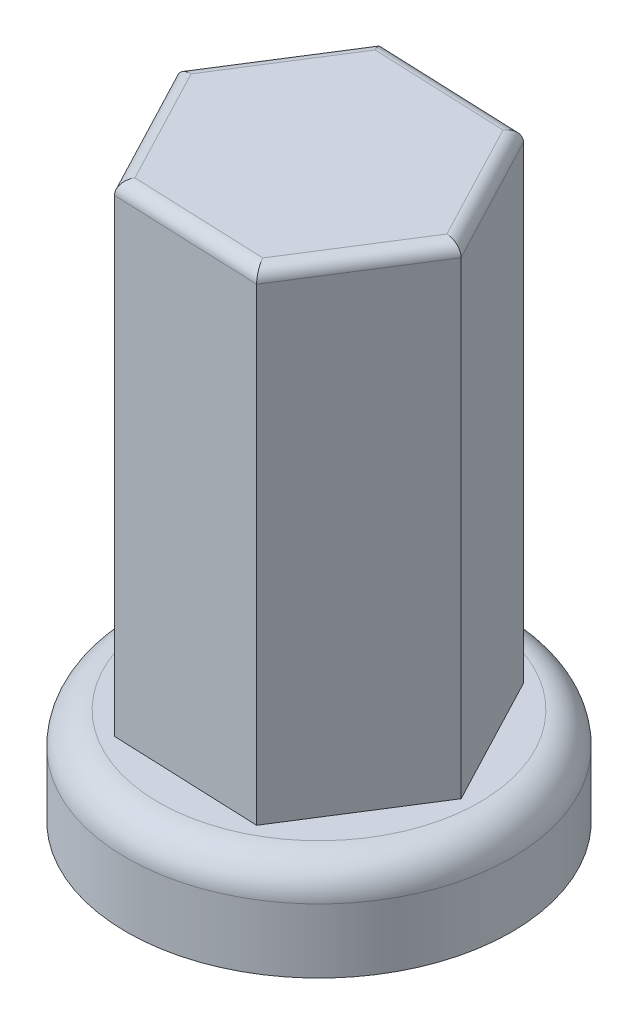
ISO-10303-21;
HEADER;
FILE_DESCRIPTION(('STEP AP214'),'2;1');
FILE_NAME('part.step','',(''),(''),'','','');
FILE_SCHEMA(('AUTOMOTIVE_DESIGN { 1 0 10303 214 1 1 1 1 }'));
ENDSEC;
DATA;
#1=APPLICATION_CONTEXT('core data for automotive mechanical design processes');
#2=APPLICATION_PROTOCOL_DEFINITION('international standard','automotive_design',2000,#1);
#3=PRODUCT_CONTEXT('',#1,'mechanical');
#4=PRODUCT('Part','Part','',(#3));
#5=PRODUCT_RELATED_PRODUCT_CATEGORY('part','',(#4));
#6=PRODUCT_DEFINITION_FORMATION('','',#4);
#7=PRODUCT_DEFINITION_CONTEXT('part definition',#1,'design');
#8=PRODUCT_DEFINITION('design','',#6,#7);
#9=PRODUCT_DEFINITION_SHAPE('','',#8);
#10=(LENGTH_UNIT() NAMED_UNIT(*) SI_UNIT(.MILLI.,.METRE.));
#11=(NAMED_UNIT(*) PLANE_ANGLE_UNIT() SI_UNIT($,.RADIAN.));
#12=(NAMED_UNIT(*) SI_UNIT($,.STERADIAN.) SOLID_ANGLE_UNIT());
#13=UNCERTAINTY_MEASURE_WITH_UNIT(LENGTH_MEASURE(1.E-05),#10,'distance_accuracy_value','');
#14=(GEOMETRIC_REPRESENTATION_CONTEXT(3) GLOBAL_UNCERTAINTY_ASSIGNED_CONTEXT((#13)) GLOBAL_UNIT_ASSIGNED_CONTEXT((#10,
#11,#12)) REPRESENTATION_CONTEXT('',''));
#15=CARTESIAN_POINT('',(0.,0.,0.));
#16=DIRECTION('',(0.,0.,1.));
#17=DIRECTION('',(1.,0.,0.));
#18=AXIS2_PLACEMENT_3D('',#15,#16,#17);
#19=CARTESIAN_POINT('',(0.,3.81,0.));
#20=DIRECTION('',(0.,1.,0.));
#21=DIRECTION('',(0.,0.,1.));
#22=AXIS2_PLACEMENT_3D('',#19,#20,#21);
#23=PLANE('',#22);
#24=CARTESIAN_POINT('',(0.,3.81,0.));
#25=DIRECTION('',(0.,1.,0.));
#26=DIRECTION('',(0.,0.,1.));
#27=AXIS2_PLACEMENT_3D('',#24,#25,#26);
#28=CIRCLE('',#27,6.35);
#29=CARTESIAN_POINT('',(0.,3.81,6.35));
#30=VERTEX_POINT('',#29);
#31=EDGE_CURVE('E145',#30,#30,#28,.T.);
#32=ORIENTED_EDGE('',*,*,#31,.T.);
#33=EDGE_LOOP('',(#32));
#34=FACE_BOUND('',#33,.T.);
#35=DIRECTION('',(-0.464619383568668,0.,-0.885510490289229));
#36=VECTOR('',#35,1.);
#37=CARTESIAN_POINT('',(5.86109377163365,3.81,0.236882108759886));
#38=LINE('',#37,#36);
#39=CARTESIAN_POINT('',(5.86109377163365,3.81,0.236882108759886));
#40=VERTEX_POINT('',#39);
#41=CARTESIAN_POINT('',(3.13569280970491,3.81,-4.95741504581755));
#42=VERTEX_POINT('',#41);
#43=EDGE_CURVE('E106',#40,#42,#38,.T.);
#44=ORIENTED_EDGE('',*,*,#43,.F.);
#45=DIRECTION('',(0.534564888123752,0.,-0.845127434405747));
#46=VECTOR('',#45,1.);
#47=CARTESIAN_POINT('',(2.72540096192874,3.81,5.19429715457744));
#48=LINE('',#47,#46);
#49=CARTESIAN_POINT('',(2.72540096192874,3.81,5.19429715457744));
#50=VERTEX_POINT('',#49);
#51=EDGE_CURVE('E113',#50,#40,#48,.T.);
#52=ORIENTED_EDGE('',*,*,#51,.F.);
#53=DIRECTION('',(0.99918427169242,0.,0.0403830558834821));
#54=VECTOR('',#53,1.);
#55=CARTESIAN_POINT('',(-3.13569280970492,3.81,4.95741504581755));
#56=LINE('',#55,#54);
#57=CARTESIAN_POINT('',(-3.13569280970492,3.81,4.95741504581755));
#58=VERTEX_POINT('',#57);
#59=EDGE_CURVE('E133',#58,#50,#56,.T.);
#60=ORIENTED_EDGE('',*,*,#59,.F.);
#61=DIRECTION('',(0.464619383568668,0.,0.885510490289229));
#62=VECTOR('',#61,1.);
#63=CARTESIAN_POINT('',(-5.86109377163366,3.81,-0.236882108759885));
#64=LINE('',#63,#62);
#65=CARTESIAN_POINT('',(-5.86109377163366,3.81,-0.236882108759885));
#66=VERTEX_POINT('',#65);
#67=EDGE_CURVE('E130',#66,#58,#64,.T.);
#68=ORIENTED_EDGE('',*,*,#67,.F.);
#69=DIRECTION('',(-0.534564888123752,0.,0.845127434405747));
#70=VECTOR('',#69,1.);
#71=CARTESIAN_POINT('',(-2.72540096192874,3.81,-5.19429715457744));
#72=LINE('',#71,#70);
#73=CARTESIAN_POINT('',(-2.72540096192874,3.81,-5.19429715457744));
#74=VERTEX_POINT('',#73);
#75=EDGE_CURVE('E124',#74,#66,#72,.T.);
#76=ORIENTED_EDGE('',*,*,#75,.F.);
#77=DIRECTION('',(-0.99918427169242,0.,-0.040383055883482));
#78=VECTOR('',#77,1.);
#79=CARTESIAN_POINT('',(3.13569280970491,3.81,-4.95741504581755));
#80=LINE('',#79,#78);
#81=EDGE_CURVE('E122',#42,#74,#80,.T.);
#82=ORIENTED_EDGE('',*,*,#81,.F.);
#83=EDGE_LOOP('',(#44,#52,#60,#68,#76,#82));
#84=FACE_BOUND('',#83,.T.);
#85=ADVANCED_FACE('F32',(#34,#84),#23,.T.);
#86=CARTESIAN_POINT('',(0.,3.81,0.));
#87=DIRECTION('',(0.,-1.,0.));
#88=DIRECTION('',(0.,0.,-1.));
#89=AXIS2_PLACEMENT_3D('',#86,#87,#88);
#90=CYLINDRICAL_SURFACE('',#89,7.62);
#91=CARTESIAN_POINT('',(0.,2.54,0.));
#92=DIRECTION('',(0.,1.,0.));
#93=DIRECTION('',(0.,0.,1.));
#94=AXIS2_PLACEMENT_3D('',#91,#92,#93);
#95=CIRCLE('',#94,7.62);
#96=CARTESIAN_POINT('',(0.,2.54,7.62));
#97=VERTEX_POINT('',#96);
#98=EDGE_CURVE('E148',#97,#97,#95,.F.);
#99=ORIENTED_EDGE('',*,*,#98,.T.);
#100=EDGE_LOOP('',(#99));
#101=FACE_BOUND('',#100,.T.);
#102=CARTESIAN_POINT('',(0.,0.,0.));
#103=DIRECTION('',(0.,1.,0.));
#104=DIRECTION('',(0.,0.,1.));
#105=AXIS2_PLACEMENT_3D('',#102,#103,#104);
#106=CIRCLE('',#105,7.62);
#107=CARTESIAN_POINT('',(0.,0.,7.62));
#108=VERTEX_POINT('',#107);
#109=EDGE_CURVE('E109',#108,#108,#106,.T.);
#110=ORIENTED_EDGE('',*,*,#109,.T.);
#111=EDGE_LOOP('',(#110));
#112=FACE_BOUND('',#111,.T.);
#113=ADVANCED_FACE('F233',(#101,#112),#90,.T.);
#114=CARTESIAN_POINT('',(0.,0.,0.));
#115=DIRECTION('',(0.,1.,0.));
#116=DIRECTION('',(0.,0.,1.));
#117=AXIS2_PLACEMENT_3D('',#114,#115,#116);
#118=PLANE('',#117);
#119=CARTESIAN_POINT('',(0.,0.,0.));
#120=DIRECTION('',(0.,-1.,0.));
#121=DIRECTION('',(0.,0.,-1.));
#122=AXIS2_PLACEMENT_3D('',#119,#120,#121);
#123=CIRCLE('',#122,4.699);
#124=CARTESIAN_POINT('',(0.,0.,-4.699));
#125=VERTEX_POINT('',#124);
#126=EDGE_CURVE('E355',#125,#125,#123,.T.);
#127=ORIENTED_EDGE('',*,*,#126,.F.);
#128=EDGE_LOOP('',(#127));
#129=FACE_BOUND('',#128,.T.);
#130=ORIENTED_EDGE('',*,*,#109,.F.);
#131=EDGE_LOOP('',(#130));
#132=FACE_BOUND('',#131,.T.);
#133=ADVANCED_FACE('F239',(#129,#132),#118,.F.);
#134=CARTESIAN_POINT('',(2.72540096192874,22.86,5.19429715457744));
#135=DIRECTION('',(-0.845127434405747,0.,-0.534564888123752));
#136=DIRECTION('',(-0.534564888123752,0.,0.845127434405747));
#137=AXIS2_PLACEMENT_3D('',#134,#135,#136);
#138=PLANE('',#137);
#139=DIRECTION('',(0.,-1.,0.));
#140=VECTOR('',#139,1.);
#141=CARTESIAN_POINT('',(5.86109377163365,22.86,0.236882108759886));
#142=LINE('',#141,#140);
#143=CARTESIAN_POINT('',(5.86109377163365,22.352,0.236882108759886));
#144=VERTEX_POINT('',#143);
#145=EDGE_CURVE('E102',#144,#40,#142,.T.);
#146=ORIENTED_EDGE('',*,*,#145,.F.);
#147=DIRECTION('',(0.534564888123752,0.,-0.845127434405747));
#148=VECTOR('',#147,1.);
#149=CARTESIAN_POINT('',(2.72540096192874,22.352,5.19429715457744));
#150=LINE('',#149,#148);
#151=CARTESIAN_POINT('',(2.72540096192874,22.352,5.19429715457744));
#152=VERTEX_POINT('',#151);
#153=EDGE_CURVE('E41',#144,#152,#150,.F.);
#154=ORIENTED_EDGE('',*,*,#153,.T.);
#155=DIRECTION('',(0.,-1.,0.));
#156=VECTOR('',#155,1.);
#157=CARTESIAN_POINT('',(2.72540096192874,22.86,5.19429715457744));
#158=LINE('',#157,#156);
#159=EDGE_CURVE('E115',#152,#50,#158,.T.);
#160=ORIENTED_EDGE('',*,*,#159,.T.);
#161=ORIENTED_EDGE('',*,*,#51,.T.);
#162=EDGE_LOOP('',(#146,#154,#160,#161));
#163=FACE_BOUND('',#162,.T.);
#164=ADVANCED_FACE('F114',(#163),#138,.F.);
#165=CARTESIAN_POINT('',(5.86109377163365,22.86,0.236882108759886));
#166=DIRECTION('',(-0.885510490289229,0.,0.464619383568668));
#167=DIRECTION('',(0.464619383568668,0.,0.885510490289229));
#168=AXIS2_PLACEMENT_3D('',#165,#166,#167);
#169=PLANE('',#168);
#170=DIRECTION('',(0.,-1.,0.));
#171=VECTOR('',#170,1.);
#172=CARTESIAN_POINT('',(3.13569280970491,22.86,-4.95741504581755));
#173=LINE('',#172,#171);
#174=CARTESIAN_POINT('',(3.13569280970491,22.352,-4.95741504581755));
#175=VERTEX_POINT('',#174);
#176=EDGE_CURVE('E110',#175,#42,#173,.T.);
#177=ORIENTED_EDGE('',*,*,#176,.F.);
#178=DIRECTION('',(-0.464619383568668,0.,-0.885510490289229));
#179=VECTOR('',#178,1.);
#180=CARTESIAN_POINT('',(5.86109377163365,22.352,0.236882108759886));
#181=LINE('',#180,#179);
#182=EDGE_CURVE('E56',#175,#144,#181,.F.);
#183=ORIENTED_EDGE('',*,*,#182,.T.);
#184=ORIENTED_EDGE('',*,*,#145,.T.);
#185=ORIENTED_EDGE('',*,*,#43,.T.);
#186=EDGE_LOOP('',(#177,#183,#184,#185));
#187=FACE_BOUND('',#186,.T.);
#188=ADVANCED_FACE('F104',(#187),#169,.F.);
#189=CARTESIAN_POINT('',(3.13569280970491,22.86,-4.95741504581755));
#190=DIRECTION('',(-0.040383055883482,0.,0.99918427169242));
#191=DIRECTION('',(0.99918427169242,0.,0.040383055883482));
#192=AXIS2_PLACEMENT_3D('',#189,#190,#191);
#193=PLANE('',#192);
#194=DIRECTION('',(0.,-1.,0.));
#195=VECTOR('',#194,1.);
#196=CARTESIAN_POINT('',(-2.72540096192874,22.86,-5.19429715457744));
#197=LINE('',#196,#195);
#198=CARTESIAN_POINT('',(-2.72540096192874,22.352,-5.19429715457744));
#199=VERTEX_POINT('',#198);
#200=EDGE_CURVE('E140',#199,#74,#197,.T.);
#201=ORIENTED_EDGE('',*,*,#200,.F.);
#202=DIRECTION('',(-0.99918427169242,0.,-0.040383055883482));
#203=VECTOR('',#202,1.);
#204=CARTESIAN_POINT('',(3.13569280970491,22.352,-4.95741504581755));
#205=LINE('',#204,#203);
#206=EDGE_CURVE('E169',#199,#175,#205,.F.);
#207=ORIENTED_EDGE('',*,*,#206,.T.);
#208=ORIENTED_EDGE('',*,*,#176,.T.);
#209=ORIENTED_EDGE('',*,*,#81,.T.);
#210=EDGE_LOOP('',(#201,#207,#208,#209));
#211=FACE_BOUND('',#210,.T.);
#212=ADVANCED_FACE('F223',(#211),#193,.F.);
#213=CARTESIAN_POINT('',(-2.72540096192874,22.86,-5.19429715457744));
#214=DIRECTION('',(0.845127434405747,0.,0.534564888123752));
#215=DIRECTION('',(0.534564888123752,0.,-0.845127434405747));
#216=AXIS2_PLACEMENT_3D('',#213,#214,#215);
#217=PLANE('',#216);
#218=DIRECTION('',(0.,-1.,0.));
#219=VECTOR('',#218,1.);
#220=CARTESIAN_POINT('',(-5.86109377163366,22.86,-0.236882108759885));
#221=LINE('',#220,#219);
#222=CARTESIAN_POINT('',(-5.86109377163366,22.352,-0.236882108759885));
#223=VERTEX_POINT('',#222);
#224=EDGE_CURVE('E138',#223,#66,#221,.T.);
#225=ORIENTED_EDGE('',*,*,#224,.F.);
#226=DIRECTION('',(-0.534564888123752,0.,0.845127434405747));
#227=VECTOR('',#226,1.);
#228=CARTESIAN_POINT('',(-2.72540096192874,22.352,-5.19429715457744));
#229=LINE('',#228,#227);
#230=EDGE_CURVE('E167',#223,#199,#229,.F.);
#231=ORIENTED_EDGE('',*,*,#230,.T.);
#232=ORIENTED_EDGE('',*,*,#200,.T.);
#233=ORIENTED_EDGE('',*,*,#75,.T.);
#234=EDGE_LOOP('',(#225,#231,#232,#233));
#235=FACE_BOUND('',#234,.T.);
#236=ADVANCED_FACE('F221',(#235),#217,.F.);
#237=CARTESIAN_POINT('',(-5.86109377163366,22.86,-0.236882108759885));
#238=DIRECTION('',(0.885510490289229,0.,-0.464619383568668));
#239=DIRECTION('',(-0.464619383568668,0.,-0.885510490289229));
#240=AXIS2_PLACEMENT_3D('',#237,#238,#239);
#241=PLANE('',#240);
#242=DIRECTION('',(0.,-1.,0.));
#243=VECTOR('',#242,1.);
#244=CARTESIAN_POINT('',(-3.13569280970492,22.86,4.95741504581755));
#245=LINE('',#244,#243);
#246=CARTESIAN_POINT('',(-3.13569280970492,22.352,4.95741504581755));
#247=VERTEX_POINT('',#246);
#248=EDGE_CURVE('E136',#247,#58,#245,.T.);
#249=ORIENTED_EDGE('',*,*,#248,.F.);
#250=DIRECTION('',(0.464619383568668,0.,0.885510490289229));
#251=VECTOR('',#250,1.);
#252=CARTESIAN_POINT('',(-5.86109377163366,22.352,-0.236882108759886));
#253=LINE('',#252,#251);
#254=EDGE_CURVE('E164',#247,#223,#253,.F.);
#255=ORIENTED_EDGE('',*,*,#254,.T.);
#256=ORIENTED_EDGE('',*,*,#224,.T.);
#257=ORIENTED_EDGE('',*,*,#67,.T.);
#258=EDGE_LOOP('',(#249,#255,#256,#257));
#259=FACE_BOUND('',#258,.T.);
#260=ADVANCED_FACE('F208',(#259),#241,.F.);
#261=CARTESIAN_POINT('',(-3.13569280970492,22.86,4.95741504581755));
#262=DIRECTION('',(0.0403830558834821,0.,-0.99918427169242));
#263=DIRECTION('',(-0.99918427169242,0.,-0.0403830558834821));
#264=AXIS2_PLACEMENT_3D('',#261,#262,#263);
#265=PLANE('',#264);
#266=ORIENTED_EDGE('',*,*,#159,.F.);
#267=DIRECTION('',(0.99918427169242,0.,0.0403830558834821));
#268=VECTOR('',#267,1.);
#269=CARTESIAN_POINT('',(-3.13569280970492,22.352,4.95741504581755));
#270=LINE('',#269,#268);
#271=EDGE_CURVE('E11',#152,#247,#270,.F.);
#272=ORIENTED_EDGE('',*,*,#271,.T.);
#273=ORIENTED_EDGE('',*,*,#248,.T.);
#274=ORIENTED_EDGE('',*,*,#59,.T.);
#275=EDGE_LOOP('',(#266,#272,#273,#274));
#276=FACE_BOUND('',#275,.T.);
#277=ADVANCED_FACE('F205',(#276),#265,.F.);
#278=CARTESIAN_POINT('',(5.86109377163365,22.86,0.236882108759887));
#279=DIRECTION('',(0.,1.,0.));
#280=DIRECTION('',(0.,0.,1.));
#281=AXIS2_PLACEMENT_3D('',#278,#279,#280);
#282=PLANE('',#281);
#283=DIRECTION('',(-0.534564888123752,0.,0.845127434405747));
#284=VECTOR('',#283,1.);
#285=CARTESIAN_POINT('',(-5.43176903495554,22.86,0.0346768544069818));
#286=LINE('',#285,#284);
#287=CARTESIAN_POINT('',(-2.45286086573586,22.86,-4.67486743911969));
#288=VERTEX_POINT('',#287);
#289=CARTESIAN_POINT('',(-5.27498439447029,22.86,-0.213193897883897));
#290=VERTEX_POINT('',#289);
#291=EDGE_CURVE('E159',#288,#290,#286,.T.);
#292=ORIENTED_EDGE('',*,*,#291,.T.);
#293=DIRECTION('',(0.464619383568668,0.,0.885510490289229));
#294=VECTOR('',#293,1.);
#295=CARTESIAN_POINT('',(-2.68585348063799,22.86,4.72138839896467));
#296=LINE('',#295,#294);
#297=CARTESIAN_POINT('',(-2.82212352873442,22.86,4.4616735412358));
#298=VERTEX_POINT('',#297);
#299=EDGE_CURVE('E161',#290,#298,#296,.T.);
#300=ORIENTED_EDGE('',*,*,#299,.T.);
#301=DIRECTION('',(0.99918427169242,0.,0.0403830558834821));
#302=VECTOR('',#301,1.);
#303=CARTESIAN_POINT('',(2.74591555431754,22.86,4.68671154455769));
#304=LINE('',#303,#302);
#305=CARTESIAN_POINT('',(2.45286086573586,22.86,4.67486743911969));
#306=VERTEX_POINT('',#305);
#307=EDGE_CURVE('E151',#298,#306,#304,.T.);
#308=ORIENTED_EDGE('',*,*,#307,.T.);
#309=DIRECTION('',(0.534564888123752,0.,-0.845127434405747));
#310=VECTOR('',#309,1.);
#311=CARTESIAN_POINT('',(5.43176903495553,22.86,-0.0346768544069797));
#312=LINE('',#311,#310);
#313=CARTESIAN_POINT('',(5.27498439447029,22.86,0.213193897883898));
#314=VERTEX_POINT('',#313);
#315=EDGE_CURVE('E153',#306,#314,#312,.T.);
#316=ORIENTED_EDGE('',*,*,#315,.T.);
#317=DIRECTION('',(-0.464619383568668,0.,-0.885510490289229));
#318=VECTOR('',#317,1.);
#319=CARTESIAN_POINT('',(2.68585348063798,22.86,-4.72138839896467));
#320=LINE('',#319,#318);
#321=CARTESIAN_POINT('',(2.82212352873442,22.86,-4.4616735412358));
#322=VERTEX_POINT('',#321);
#323=EDGE_CURVE('E155',#314,#322,#320,.T.);
#324=ORIENTED_EDGE('',*,*,#323,.T.);
#325=DIRECTION('',(-0.99918427169242,0.,-0.040383055883482));
#326=VECTOR('',#325,1.);
#327=CARTESIAN_POINT('',(-2.74591555431755,22.86,-4.68671154455769));
#328=LINE('',#327,#326);
#329=EDGE_CURVE('E157',#322,#288,#328,.T.);
#330=ORIENTED_EDGE('',*,*,#329,.T.);
#331=EDGE_LOOP('',(#292,#300,#308,#316,#324,#330));
#332=FACE_BOUND('',#331,.T.);
#333=ADVANCED_FACE('F250',(#332),#282,.T.);
#334=CARTESIAN_POINT('',(0.,2.54,0.));
#335=DIRECTION('',(0.,1.,0.));
#336=DIRECTION('',(0.,0.,1.));
#337=AXIS2_PLACEMENT_3D('',#334,#335,#336);
#338=TOROIDAL_SURFACE('',#337,6.35,1.27);
#339=ORIENTED_EDGE('',*,*,#98,.F.);
#340=EDGE_LOOP('',(#339));
#341=FACE_BOUND('',#340,.T.);
#342=ORIENTED_EDGE('',*,*,#31,.F.);
#343=EDGE_LOOP('',(#342));
#344=FACE_BOUND('',#343,.T.);
#345=ADVANCED_FACE('F247',(#341,#344),#338,.T.);
#346=CARTESIAN_POINT('',(5.41125444256672,22.352,0.47290875561277));
#347=DIRECTION('',(0.464619383568668,0.,0.885510490289229));
#348=DIRECTION('',(0.885510490289229,0.,-0.464619383568668));
#349=AXIS2_PLACEMENT_3D('',#346,#347,#348);
#350=CYLINDRICAL_SURFACE('',#349,0.508);
#351=CARTESIAN_POINT('',(5.27498439447029,22.352,0.213193897883898));
#352=DIRECTION('',(-0.0403830558834822,0.,0.99918427169242));
#353=DIRECTION('',(-0.99918427169242,0.,-0.0403830558834823));
#354=AXIS2_PLACEMENT_3D('',#351,#352,#353);
#355=ELLIPSE('',#354,0.58658787349666,0.508);
#356=EDGE_CURVE('E183',#144,#314,#355,.T.);
#357=ORIENTED_EDGE('',*,*,#356,.F.);
#358=ORIENTED_EDGE('',*,*,#182,.F.);
#359=CARTESIAN_POINT('',(2.82212352873442,22.352,-4.4616735412358));
#360=DIRECTION('',(0.845127434405747,0.,0.534564888123752));
#361=DIRECTION('',(-0.534564888123752,0.,0.845127434405747));
#362=AXIS2_PLACEMENT_3D('',#359,#360,#361);
#363=ELLIPSE('',#362,0.58658787349666,0.508);
#364=EDGE_CURVE('E36',#322,#175,#363,.F.);
#365=ORIENTED_EDGE('',*,*,#364,.F.);
#366=ORIENTED_EDGE('',*,*,#323,.F.);
#367=EDGE_LOOP('',(#357,#358,#365,#366));
#368=FACE_BOUND('',#367,.T.);
#369=ADVANCED_FACE('F34',(#368),#350,.T.);
#370=CARTESIAN_POINT('',(6.04572510313293,22.352,-4.33138838141786));
#371=DIRECTION('',(0.99918427169242,0.,0.040383055883482));
#372=DIRECTION('',(0.040383055883482,0.,-0.99918427169242));
#373=AXIS2_PLACEMENT_3D('',#370,#371,#372);
#374=CYLINDRICAL_SURFACE('',#373,0.508);
#375=ORIENTED_EDGE('',*,*,#364,.T.);
#376=ORIENTED_EDGE('',*,*,#206,.F.);
#377=CARTESIAN_POINT('',(-2.45286086573586,22.352,-4.67486743911969));
#378=DIRECTION('',(0.885510490289229,0.,-0.464619383568668));
#379=DIRECTION('',(0.464619383568668,0.,0.885510490289229));
#380=AXIS2_PLACEMENT_3D('',#377,#378,#379);
#381=ELLIPSE('',#380,0.58658787349666,0.508);
#382=EDGE_CURVE('E181',#288,#199,#381,.F.);
#383=ORIENTED_EDGE('',*,*,#382,.F.);
#384=ORIENTED_EDGE('',*,*,#329,.F.);
#385=EDGE_LOOP('',(#375,#376,#383,#384));
#386=FACE_BOUND('',#385,.T.);
#387=ADVANCED_FACE('F192',(#386),#374,.T.);
#388=CARTESIAN_POINT('',(5.43176903495553,22.352,-0.0346768544069794));
#389=DIRECTION('',(-0.534564888123752,0.,0.845127434405747));
#390=DIRECTION('',(0.845127434405747,0.,0.534564888123752));
#391=AXIS2_PLACEMENT_3D('',#388,#389,#390);
#392=CYLINDRICAL_SURFACE('',#391,0.508);
#393=ORIENTED_EDGE('',*,*,#356,.T.);
#394=ORIENTED_EDGE('',*,*,#315,.F.);
#395=CARTESIAN_POINT('',(2.45286086573586,22.352,4.67486743911969));
#396=DIRECTION('',(-0.885510490289229,0.,0.464619383568668));
#397=DIRECTION('',(-0.464619383568668,0.,-0.885510490289229));
#398=AXIS2_PLACEMENT_3D('',#395,#396,#397);
#399=ELLIPSE('',#398,0.58658787349666,0.508);
#400=EDGE_CURVE('E178',#152,#306,#399,.T.);
#401=ORIENTED_EDGE('',*,*,#400,.F.);
#402=ORIENTED_EDGE('',*,*,#153,.F.);
#403=EDGE_LOOP('',(#393,#394,#401,#402));
#404=FACE_BOUND('',#403,.T.);
#405=ADVANCED_FACE('F197',(#404),#392,.T.);
#406=CARTESIAN_POINT('',(-2.29607622525062,22.352,-4.92273819141057));
#407=DIRECTION('',(0.534564888123752,0.,-0.845127434405747));
#408=DIRECTION('',(-0.845127434405747,0.,-0.534564888123752));
#409=AXIS2_PLACEMENT_3D('',#406,#407,#408);
#410=CYLINDRICAL_SURFACE('',#409,0.508);
#411=ORIENTED_EDGE('',*,*,#382,.T.);
#412=ORIENTED_EDGE('',*,*,#230,.F.);
#413=CARTESIAN_POINT('',(-5.27498439447029,22.352,-0.2131938978839));
#414=DIRECTION('',(0.040383055883482,0.,-0.99918427169242));
#415=DIRECTION('',(0.99918427169242,0.,0.0403830558834822));
#416=AXIS2_PLACEMENT_3D('',#413,#414,#415);
#417=ELLIPSE('',#416,0.58658787349666,0.508);
#418=EDGE_CURVE('E175',#290,#223,#417,.F.);
#419=ORIENTED_EDGE('',*,*,#418,.F.);
#420=ORIENTED_EDGE('',*,*,#291,.F.);
#421=EDGE_LOOP('',(#411,#412,#419,#420));
#422=FACE_BOUND('',#421,.T.);
#423=ADVANCED_FACE('F218',(#422),#410,.T.);
#424=CARTESIAN_POINT('',(5.67646244013437,22.352,4.80515259893763));
#425=DIRECTION('',(-0.99918427169242,0.,-0.0403830558834821));
#426=DIRECTION('',(-0.0403830558834821,0.,0.99918427169242));
#427=AXIS2_PLACEMENT_3D('',#424,#425,#426);
#428=CYLINDRICAL_SURFACE('',#427,0.508);
#429=ORIENTED_EDGE('',*,*,#400,.T.);
#430=ORIENTED_EDGE('',*,*,#307,.F.);
#431=CARTESIAN_POINT('',(-2.82212352873442,22.352,4.4616735412358));
#432=DIRECTION('',(-0.845127434405747,0.,-0.534564888123752));
#433=DIRECTION('',(-0.534564888123752,0.,0.845127434405747));
#434=AXIS2_PLACEMENT_3D('',#431,#432,#433);
#435=ELLIPSE('',#434,0.58658787349666,0.508);
#436=EDGE_CURVE('E173',#247,#298,#435,.T.);
#437=ORIENTED_EDGE('',*,*,#436,.F.);
#438=ORIENTED_EDGE('',*,*,#271,.F.);
#439=EDGE_LOOP('',(#429,#430,#437,#438));
#440=FACE_BOUND('',#439,.T.);
#441=ADVANCED_FACE('F202',(#440),#428,.T.);
#442=CARTESIAN_POINT('',(-2.68585348063798,22.352,4.72138839896467));
#443=DIRECTION('',(-0.464619383568668,0.,-0.885510490289229));
#444=DIRECTION('',(-0.885510490289229,0.,0.464619383568668));
#445=AXIS2_PLACEMENT_3D('',#442,#443,#444);
#446=CYLINDRICAL_SURFACE('',#445,0.508);
#447=ORIENTED_EDGE('',*,*,#418,.T.);
#448=ORIENTED_EDGE('',*,*,#254,.F.);
#449=ORIENTED_EDGE('',*,*,#436,.T.);
#450=ORIENTED_EDGE('',*,*,#299,.F.);
#451=EDGE_LOOP('',(#447,#448,#449,#450));
#452=FACE_BOUND('',#451,.T.);
#453=ADVANCED_FACE('F212',(#452),#446,.T.);
#454=CARTESIAN_POINT('',(0.,19.05,0.));
#455=DIRECTION('',(0.,-1.,0.));
#456=DIRECTION('',(0.,0.,-1.));
#457=AXIS2_PLACEMENT_3D('',#454,#455,#456);
#458=CYLINDRICAL_SURFACE('',#457,4.699);
#459=CARTESIAN_POINT('',(0.,19.05,0.));
#460=DIRECTION('',(0.,-1.,0.));
#461=DIRECTION('',(0.,0.,-1.));
#462=AXIS2_PLACEMENT_3D('',#459,#460,#461);
#463=CIRCLE('',#462,4.699);
#464=CARTESIAN_POINT('',(0.,19.05,-4.699));
#465=VERTEX_POINT('',#464);
#466=EDGE_CURVE('E176',#465,#465,#463,.T.);
#467=ORIENTED_EDGE('',*,*,#466,.F.);
#468=EDGE_LOOP('',(#467));
#469=FACE_BOUND('',#468,.T.);
#470=ORIENTED_EDGE('',*,*,#126,.T.);
#471=EDGE_LOOP('',(#470));
#472=FACE_BOUND('',#471,.T.);
#473=ADVANCED_FACE('F254',(#469,#472),#458,.F.);
#474=CARTESIAN_POINT('',(0.,19.05,0.));
#475=DIRECTION('',(0.,-1.,0.));
#476=DIRECTION('',(0.,0.,-1.));
#477=AXIS2_PLACEMENT_3D('',#474,#475,#476);
#478=PLANE('',#477);
#479=ORIENTED_EDGE('',*,*,#466,.T.);
#480=EDGE_LOOP('',(#479));
#481=FACE_BOUND('',#480,.T.);
#482=ADVANCED_FACE('F339',(#481),#478,.T.);
#483=CLOSED_SHELL('',(#85,#113,#133,#164,#188,#212,#236,#260,#277,#333,#345,#369,#387,#405,#423,
#441,#453,#473,#482));
#484=MANIFOLD_SOLID_BREP('B2',#483);
#485=ADVANCED_BREP_SHAPE_REPRESENTATION('',(#18,#484),#14);
#486=SHAPE_DEFINITION_REPRESENTATION(#9,#485);
ENDSEC;
END-ISO-10303-21;
